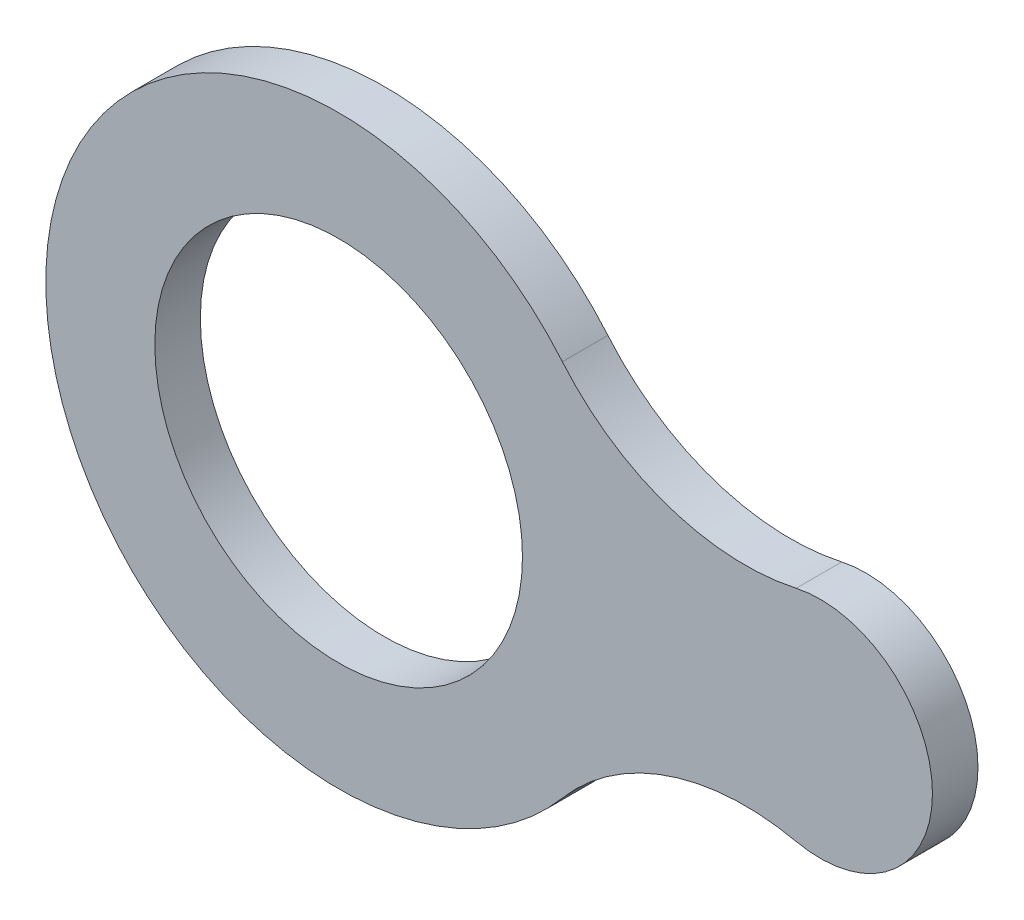
ISO-10303-21;
HEADER;
FILE_DESCRIPTION(('STEP AP214'),'2;1');
FILE_NAME('part.step','',(''),(''),'','','');
FILE_SCHEMA(('AUTOMOTIVE_DESIGN { 1 0 10303 214 1 1 1 1 }'));
ENDSEC;
DATA;
#1=APPLICATION_CONTEXT('core data for automotive mechanical design processes');
#2=APPLICATION_PROTOCOL_DEFINITION('international standard','automotive_design',2000,#1);
#3=PRODUCT_CONTEXT('',#1,'mechanical');
#4=PRODUCT('Part','Part','',(#3));
#5=PRODUCT_RELATED_PRODUCT_CATEGORY('part','',(#4));
#6=PRODUCT_DEFINITION_FORMATION('','',#4);
#7=PRODUCT_DEFINITION_CONTEXT('part definition',#1,'design');
#8=PRODUCT_DEFINITION('design','',#6,#7);
#9=PRODUCT_DEFINITION_SHAPE('','',#8);
#10=(LENGTH_UNIT() NAMED_UNIT(*) SI_UNIT(.MILLI.,.METRE.));
#11=(NAMED_UNIT(*) PLANE_ANGLE_UNIT() SI_UNIT($,.RADIAN.));
#12=(NAMED_UNIT(*) SI_UNIT($,.STERADIAN.) SOLID_ANGLE_UNIT());
#13=UNCERTAINTY_MEASURE_WITH_UNIT(LENGTH_MEASURE(1.E-05),#10,'distance_accuracy_value','');
#14=(GEOMETRIC_REPRESENTATION_CONTEXT(3) GLOBAL_UNCERTAINTY_ASSIGNED_CONTEXT((#13)) GLOBAL_UNIT_ASSIGNED_CONTEXT((#10,
#11,#12)) REPRESENTATION_CONTEXT('',''));
#15=CARTESIAN_POINT('',(0.,0.,0.));
#16=DIRECTION('',(0.,0.,1.));
#17=DIRECTION('',(1.,0.,0.));
#18=AXIS2_PLACEMENT_3D('',#15,#16,#17);
#19=CARTESIAN_POINT('',(68.2247620418789,26.3701987783427,6.99999999999981));
#20=DIRECTION('',(0.,0.,1.));
#21=DIRECTION('',(1.,0.,0.));
#22=AXIS2_PLACEMENT_3D('',#19,#20,#21);
#23=PLANE('',#22);
#24=CARTESIAN_POINT('',(62.4495240837573,52.7403975566849,7.00000000000003));
#25=DIRECTION('',(0.,0.,1.));
#26=DIRECTION('',(1.,0.,0.));
#27=AXIS2_PLACEMENT_3D('',#24,#25,#26);
#28=CIRCLE('',#27,36.740397556685);
#29=CARTESIAN_POINT('',(34.3799231196579,29.034821960648,7.00000000000012));
#30=VERTEX_POINT('',#29);
#31=CARTESIAN_POINT('',(70.3096084012724,16.8506234260948,7.00000000000012));
#32=VERTEX_POINT('',#31);
#33=EDGE_CURVE('E93',#30,#32,#28,.T.);
#34=ORIENTED_EDGE('',*,*,#33,.F.);
#35=CARTESIAN_POINT('',(1.11022302462516E-13,0.,7.0000000000002));
#36=DIRECTION('',(0.,0.,1.));
#37=DIRECTION('',(1.,0.,0.));
#38=AXIS2_PLACEMENT_3D('',#35,#36,#37);
#39=CIRCLE('',#38,45.);
#40=CARTESIAN_POINT('',(34.3799231196574,-29.0348219606458,7.00000000000012));
#41=VERTEX_POINT('',#40);
#42=EDGE_CURVE('E83',#30,#41,#39,.T.);
#43=ORIENTED_EDGE('',*,*,#42,.T.);
#44=CARTESIAN_POINT('',(62.4495240837575,-52.740397556684,7.00000000000012));
#45=DIRECTION('',(0.,0.,-1.));
#46=DIRECTION('',(-1.,0.,0.));
#47=AXIS2_PLACEMENT_3D('',#44,#45,#46);
#48=CIRCLE('',#47,36.740397556685);
#49=CARTESIAN_POINT('',(70.3096084012723,-16.8506234260941,7.00000000000012));
#50=VERTEX_POINT('',#49);
#51=EDGE_CURVE('E78',#41,#50,#48,.T.);
#52=ORIENTED_EDGE('',*,*,#51,.T.);
#53=CARTESIAN_POINT('',(74.0000000000006,4.44089209850063E-13,6.9999999999999));
#54=DIRECTION('',(0.,0.,-1.));
#55=DIRECTION('',(-1.,0.,0.));
#56=AXIS2_PLACEMENT_3D('',#53,#54,#55);
#57=CIRCLE('',#56,17.25);
#58=EDGE_CURVE('E82',#32,#50,#57,.T.);
#59=ORIENTED_EDGE('',*,*,#58,.F.);
#60=EDGE_LOOP('',(#34,#43,#52,#59));
#61=FACE_BOUND('',#60,.T.);
#62=CARTESIAN_POINT('',(1.11022302462516E-13,0.,7.0000000000002));
#63=DIRECTION('',(0.,0.,1.));
#64=DIRECTION('',(1.,0.,0.));
#65=AXIS2_PLACEMENT_3D('',#62,#63,#64);
#66=CIRCLE('',#65,28.25);
#67=CARTESIAN_POINT('',(28.2500000000002,0.,7.00000000000021));
#68=VERTEX_POINT('',#67);
#69=EDGE_CURVE('E103',#68,#68,#66,.T.);
#70=ORIENTED_EDGE('',*,*,#69,.F.);
#71=EDGE_LOOP('',(#70));
#72=FACE_BOUND('',#71,.T.);
#73=ADVANCED_FACE('F32',(#61,#72),#23,.T.);
#74=CARTESIAN_POINT('',(68.2247620418789,26.3701987783433,1.38777878078145E-13));
#75=DIRECTION('',(0.,0.,1.));
#76=DIRECTION('',(1.,0.,0.));
#77=AXIS2_PLACEMENT_3D('',#74,#75,#76);
#78=PLANE('',#77);
#79=CARTESIAN_POINT('',(62.4495240837577,52.7403975566851,0.));
#80=DIRECTION('',(0.,0.,1.));
#81=DIRECTION('',(1.,0.,0.));
#82=AXIS2_PLACEMENT_3D('',#79,#80,#81);
#83=CIRCLE('',#82,36.740397556685);
#84=CARTESIAN_POINT('',(34.3799231196579,29.034821960648,0.));
#85=VERTEX_POINT('',#84);
#86=CARTESIAN_POINT('',(70.3096084012725,16.8506234260959,0.));
#87=VERTEX_POINT('',#86);
#88=EDGE_CURVE('E99',#85,#87,#83,.T.);
#89=ORIENTED_EDGE('',*,*,#88,.T.);
#90=CARTESIAN_POINT('',(74.0000000000011,4.44089209850063E-13,0.));
#91=DIRECTION('',(0.,0.,-1.));
#92=DIRECTION('',(-1.,0.,0.));
#93=AXIS2_PLACEMENT_3D('',#90,#91,#92);
#94=CIRCLE('',#93,17.25);
#95=CARTESIAN_POINT('',(70.3096084012723,-16.8506234260941,0.));
#96=VERTEX_POINT('',#95);
#97=EDGE_CURVE('E102',#87,#96,#94,.T.);
#98=ORIENTED_EDGE('',*,*,#97,.T.);
#99=CARTESIAN_POINT('',(62.4495240837578,-52.7403975566849,0.));
#100=DIRECTION('',(0.,0.,-1.));
#101=DIRECTION('',(-1.,0.,0.));
#102=AXIS2_PLACEMENT_3D('',#99,#100,#101);
#103=CIRCLE('',#102,36.740397556685);
#104=CARTESIAN_POINT('',(34.3799231196578,-29.0348219606451,0.));
#105=VERTEX_POINT('',#104);
#106=EDGE_CURVE('E90',#105,#96,#103,.T.);
#107=ORIENTED_EDGE('',*,*,#106,.F.);
#108=CARTESIAN_POINT('',(0.,0.,0.));
#109=DIRECTION('',(0.,0.,1.));
#110=DIRECTION('',(1.,0.,0.));
#111=AXIS2_PLACEMENT_3D('',#108,#109,#110);
#112=CIRCLE('',#111,45.);
#113=EDGE_CURVE('E66',#85,#105,#112,.T.);
#114=ORIENTED_EDGE('',*,*,#113,.F.);
#115=EDGE_LOOP('',(#89,#98,#107,#114));
#116=FACE_BOUND('',#115,.T.);
#117=CARTESIAN_POINT('',(0.,0.,0.));
#118=DIRECTION('',(0.,0.,1.));
#119=DIRECTION('',(1.,0.,0.));
#120=AXIS2_PLACEMENT_3D('',#117,#118,#119);
#121=CIRCLE('',#120,28.25);
#122=CARTESIAN_POINT('',(28.2500000000001,0.,0.));
#123=VERTEX_POINT('',#122);
#124=EDGE_CURVE('E138',#123,#123,#121,.T.);
#125=ORIENTED_EDGE('',*,*,#124,.T.);
#126=EDGE_LOOP('',(#125));
#127=FACE_BOUND('',#126,.T.);
#128=ADVANCED_FACE('F108',(#116,#127),#78,.F.);
#129=CARTESIAN_POINT('',(62.4495240837573,52.7403975566849,7.00000000000003));
#130=DIRECTION('',(0.,0.,-1.));
#131=DIRECTION('',(-1.,0.,0.));
#132=AXIS2_PLACEMENT_3D('',#129,#130,#131);
#133=CYLINDRICAL_SURFACE('',#132,36.740397556685);
#134=ORIENTED_EDGE('',*,*,#88,.F.);
#135=DIRECTION('',(0.,0.,-1.));
#136=VECTOR('',#135,1.);
#137=CARTESIAN_POINT('',(34.3799231196579,29.034821960648,7.00000000000012));
#138=LINE('',#137,#136);
#139=EDGE_CURVE('E11',#30,#85,#138,.T.);
#140=ORIENTED_EDGE('',*,*,#139,.F.);
#141=ORIENTED_EDGE('',*,*,#33,.T.);
#142=DIRECTION('',(0.,0.,-1.));
#143=VECTOR('',#142,1.);
#144=CARTESIAN_POINT('',(70.3096084012724,16.8506234260948,7.00000000000012));
#145=LINE('',#144,#143);
#146=EDGE_CURVE('E36',#32,#87,#145,.T.);
#147=ORIENTED_EDGE('',*,*,#146,.T.);
#148=EDGE_LOOP('',(#134,#140,#141,#147));
#149=FACE_BOUND('',#148,.T.);
#150=ADVANCED_FACE('F34',(#149),#133,.F.);
#151=CARTESIAN_POINT('',(1.11022302462516E-13,0.,7.0000000000002));
#152=DIRECTION('',(0.,0.,-1.));
#153=DIRECTION('',(-1.,0.,0.));
#154=AXIS2_PLACEMENT_3D('',#151,#152,#153);
#155=CYLINDRICAL_SURFACE('',#154,45.);
#156=ORIENTED_EDGE('',*,*,#113,.T.);
#157=DIRECTION('',(0.,0.,-1.));
#158=VECTOR('',#157,1.);
#159=CARTESIAN_POINT('',(34.3799231196574,-29.0348219606458,7.00000000000012));
#160=LINE('',#159,#158);
#161=EDGE_CURVE('E42',#41,#105,#160,.T.);
#162=ORIENTED_EDGE('',*,*,#161,.F.);
#163=ORIENTED_EDGE('',*,*,#42,.F.);
#164=ORIENTED_EDGE('',*,*,#139,.T.);
#165=EDGE_LOOP('',(#156,#162,#163,#164));
#166=FACE_BOUND('',#165,.T.);
#167=ADVANCED_FACE('F111',(#166),#155,.T.);
#168=CARTESIAN_POINT('',(62.4495240837575,-52.740397556684,7.00000000000012));
#169=DIRECTION('',(0.,0.,-1.));
#170=DIRECTION('',(-1.,0.,0.));
#171=AXIS2_PLACEMENT_3D('',#168,#169,#170);
#172=CYLINDRICAL_SURFACE('',#171,36.740397556685);
#173=ORIENTED_EDGE('',*,*,#106,.T.);
#174=DIRECTION('',(0.,0.,-1.));
#175=VECTOR('',#174,1.);
#176=CARTESIAN_POINT('',(70.3096084012723,-16.8506234260941,7.00000000000012));
#177=LINE('',#176,#175);
#178=EDGE_CURVE('E87',#50,#96,#177,.T.);
#179=ORIENTED_EDGE('',*,*,#178,.F.);
#180=ORIENTED_EDGE('',*,*,#51,.F.);
#181=ORIENTED_EDGE('',*,*,#161,.T.);
#182=EDGE_LOOP('',(#173,#179,#180,#181));
#183=FACE_BOUND('',#182,.T.);
#184=ADVANCED_FACE('F88',(#183),#172,.F.);
#185=CARTESIAN_POINT('',(74.0000000000006,4.44089209850063E-13,6.9999999999999));
#186=DIRECTION('',(0.,0.,-1.));
#187=DIRECTION('',(-1.,0.,0.));
#188=AXIS2_PLACEMENT_3D('',#185,#186,#187);
#189=CYLINDRICAL_SURFACE('',#188,17.25);
#190=ORIENTED_EDGE('',*,*,#97,.F.);
#191=ORIENTED_EDGE('',*,*,#146,.F.);
#192=ORIENTED_EDGE('',*,*,#58,.T.);
#193=ORIENTED_EDGE('',*,*,#178,.T.);
#194=EDGE_LOOP('',(#190,#191,#192,#193));
#195=FACE_BOUND('',#194,.T.);
#196=ADVANCED_FACE('F92',(#195),#189,.T.);
#197=CARTESIAN_POINT('',(1.11022302462516E-13,0.,7.0000000000002));
#198=DIRECTION('',(0.,0.,-1.));
#199=DIRECTION('',(-1.,0.,0.));
#200=AXIS2_PLACEMENT_3D('',#197,#198,#199);
#201=CYLINDRICAL_SURFACE('',#200,28.25);
#202=ORIENTED_EDGE('',*,*,#69,.T.);
#203=EDGE_LOOP('',(#202));
#204=FACE_BOUND('',#203,.T.);
#205=ORIENTED_EDGE('',*,*,#124,.F.);
#206=EDGE_LOOP('',(#205));
#207=FACE_BOUND('',#206,.T.);
#208=ADVANCED_FACE('F123',(#204,#207),#201,.F.);
#209=CLOSED_SHELL('',(#73,#128,#150,#167,#184,#196,#208));
#210=MANIFOLD_SOLID_BREP('B2',#209);
#211=ADVANCED_BREP_SHAPE_REPRESENTATION('',(#18,#210),#14);
#212=SHAPE_DEFINITION_REPRESENTATION(#9,#211);
ENDSEC;
END-ISO-10303-21;
